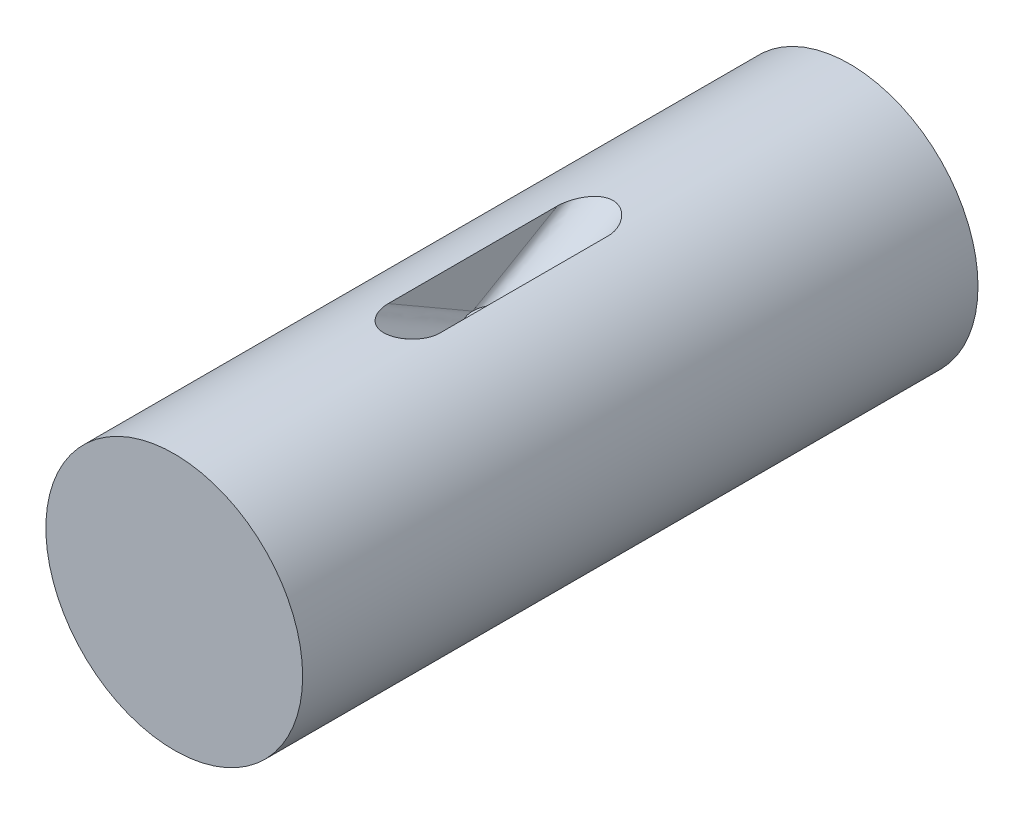
ISO-10303-21;
HEADER;
FILE_DESCRIPTION(('STEP AP214'),'2;1');
FILE_NAME('part.step','',(''),(''),'','','');
FILE_SCHEMA(('AUTOMOTIVE_DESIGN { 1 0 10303 214 1 1 1 1 }'));
ENDSEC;
DATA;
#1=APPLICATION_CONTEXT('core data for automotive mechanical design processes');
#2=APPLICATION_PROTOCOL_DEFINITION('international standard','automotive_design',2000,#1);
#3=PRODUCT_CONTEXT('',#1,'mechanical');
#4=PRODUCT('Part','Part','',(#3));
#5=PRODUCT_RELATED_PRODUCT_CATEGORY('part','',(#4));
#6=PRODUCT_DEFINITION_FORMATION('','',#4);
#7=PRODUCT_DEFINITION_CONTEXT('part definition',#1,'design');
#8=PRODUCT_DEFINITION('design','',#6,#7);
#9=PRODUCT_DEFINITION_SHAPE('','',#8);
#10=(LENGTH_UNIT() NAMED_UNIT(*) SI_UNIT(.MILLI.,.METRE.));
#11=(NAMED_UNIT(*) PLANE_ANGLE_UNIT() SI_UNIT($,.RADIAN.));
#12=(NAMED_UNIT(*) SI_UNIT($,.STERADIAN.) SOLID_ANGLE_UNIT());
#13=UNCERTAINTY_MEASURE_WITH_UNIT(LENGTH_MEASURE(1.E-05),#10,'distance_accuracy_value','');
#14=(GEOMETRIC_REPRESENTATION_CONTEXT(3) GLOBAL_UNCERTAINTY_ASSIGNED_CONTEXT((#13)) GLOBAL_UNIT_ASSIGNED_CONTEXT((#10,
#11,#12)) REPRESENTATION_CONTEXT('',''));
#15=CARTESIAN_POINT('',(0.,0.,0.));
#16=DIRECTION('',(0.,0.,1.));
#17=DIRECTION('',(1.,0.,0.));
#18=AXIS2_PLACEMENT_3D('',#15,#16,#17);
#19=CARTESIAN_POINT('',(-10.,0.,0.));
#20=DIRECTION('',(-1.,0.,0.));
#21=DIRECTION('',(0.,0.,1.));
#22=AXIS2_PLACEMENT_3D('',#19,#20,#21);
#23=PLANE('',#22);
#24=DIRECTION('',(0.,0.500000000000001,0.866025403784438));
#25=VECTOR('',#24,1.);
#26=CARTESIAN_POINT('',(-10.,30.,136.7674785701));
#27=LINE('',#26,#25);
#28=CARTESIAN_POINT('',(-9.99999999999999,30.,136.7674785701));
#29=VERTEX_POINT('',#28);
#30=CARTESIAN_POINT('',(-10.,48.9897948556636,169.658768085419));
#31=VERTEX_POINT('',#30);
#32=EDGE_CURVE('E85',#29,#31,#27,.T.);
#33=ORIENTED_EDGE('',*,*,#32,.F.);
#34=DIRECTION('',(0.,0.500000000000001,-0.866025403784438));
#35=VECTOR('',#34,1.);
#36=CARTESIAN_POINT('',(-10.,30.,136.7674785701));
#37=LINE('',#36,#35);
#38=CARTESIAN_POINT('',(-10.,48.9897948556636,103.87618905478));
#39=VERTEX_POINT('',#38);
#40=EDGE_CURVE('E71',#29,#39,#37,.T.);
#41=ORIENTED_EDGE('',*,*,#40,.T.);
#42=DIRECTION('',(0.,0.,-1.));
#43=VECTOR('',#42,1.);
#44=CARTESIAN_POINT('',(-10.,48.9897948556636,263.));
#45=LINE('',#44,#43);
#46=EDGE_CURVE('E106',#31,#39,#45,.T.);
#47=ORIENTED_EDGE('',*,*,#46,.F.);
#48=EDGE_LOOP('',(#33,#41,#47));
#49=FACE_BOUND('',#48,.T.);
#50=ADVANCED_FACE('F60',(#49),#23,.F.);
#51=CARTESIAN_POINT('',(0.,30.,136.7674785701));
#52=DIRECTION('',(0.,1.,0.));
#53=DIRECTION('',(0.,0.,1.));
#54=AXIS2_PLACEMENT_3D('',#51,#52,#53);
#55=CIRCLE('',#54,9.99999999999999);
#56=DIRECTION('',(0.,0.500000000000001,0.866025403784438));
#57=VECTOR('',#56,1.);
#58=SURFACE_OF_LINEAR_EXTRUSION('',#55,#57);
#59=DIRECTION('',(0.,0.500000000000001,0.866025403784438));
#60=VECTOR('',#59,1.);
#61=CARTESIAN_POINT('',(10.,30.,136.7674785701));
#62=LINE('',#61,#60);
#63=CARTESIAN_POINT('',(9.99999999999999,30.,136.7674785701));
#64=VERTEX_POINT('',#63);
#65=CARTESIAN_POINT('',(9.99999999999999,48.9897948556636,169.658768085419));
#66=VERTEX_POINT('',#65);
#67=EDGE_CURVE('E14',#64,#66,#62,.T.);
#68=ORIENTED_EDGE('',*,*,#67,.F.);
#69=CARTESIAN_POINT('',(0.,30.,136.7674785701));
#70=DIRECTION('',(0.,1.,0.));
#71=DIRECTION('',(0.,0.,1.));
#72=AXIS2_PLACEMENT_3D('',#69,#70,#71);
#73=CIRCLE('',#72,9.99999999999999);
#74=EDGE_CURVE('E77',#29,#64,#73,.T.);
#75=ORIENTED_EDGE('',*,*,#74,.F.);
#76=ORIENTED_EDGE('',*,*,#32,.T.);
#77=CARTESIAN_POINT('',(9.99999999999999,48.9897948556636,169.658768085419));
#78=CARTESIAN_POINT('',(9.99998830047568,48.9897926273459,169.8665816161));
#79=CARTESIAN_POINT('',(9.99352233743252,48.9911171356158,170.074343291986));
#80=CARTESIAN_POINT('',(9.96848354468941,48.9962204179087,170.488814257056));
#81=CARTESIAN_POINT('',(9.94992807804395,48.9999956721201,170.695524627699));
#82=CARTESIAN_POINT('',(9.90151605074032,49.0098006036935,171.107469975176));
#83=CARTESIAN_POINT('',(9.87166353401655,49.0158294743331,171.312705453212));
#84=CARTESIAN_POINT('',(9.8014739695633,49.0299132212895,171.720474961464));
#85=CARTESIAN_POINT('',(9.76117806287824,49.0379601436893,171.923016384806));
#86=CARTESIAN_POINT('',(9.67062226873041,49.0558986644493,172.325846038853));
#87=CARTESIAN_POINT('',(9.62035887017794,49.0657909127599,172.526133449227));
#88=CARTESIAN_POINT('',(9.51037757363829,49.0872269884544,172.924020559172));
#89=CARTESIAN_POINT('',(9.45065835361229,49.0987710467597,173.121619878714));
#90=CARTESIAN_POINT('',(9.28608459291831,49.1302258532902,173.624004154824));
#91=CARTESIAN_POINT('',(9.17472643871901,49.1511924592319,173.926614374921));
#92=CARTESIAN_POINT('',(8.93128216560779,49.1960111228789,174.523084850676));
#93=CARTESIAN_POINT('',(8.79919784648421,49.2198629300021,174.816945863452));
#94=CARTESIAN_POINT('',(8.51483599936621,49.26985344743,175.395360951603));
#95=CARTESIAN_POINT('',(8.36251368921055,49.2959971843094,175.679892589956));
#96=CARTESIAN_POINT('',(8.03846755289753,49.349873556924,176.237540683074));
#97=CARTESIAN_POINT('',(7.86674339725267,49.3776062196387,176.510656943871));
#98=CARTESIAN_POINT('',(7.50125774190784,49.4344606046001,177.048168827099));
#99=CARTESIAN_POINT('',(7.30718352420845,49.4635975746352,177.312350665298));
#100=CARTESIAN_POINT('',(6.89944438188211,49.5221171701604,177.825193069468));
#101=CARTESIAN_POINT('',(6.68577772151978,49.5514998172055,178.073852256969));
#102=CARTESIAN_POINT('',(6.23936303756008,49.6096858176845,178.552664250905));
#103=CARTESIAN_POINT('',(6.00665131865289,49.6384901487053,178.782850684533));
#104=CARTESIAN_POINT('',(5.52188385272652,49.6947514011369,179.222255621507));
#105=CARTESIAN_POINT('',(5.26982612323368,49.7222081839843,179.431471970874));
#106=CARTESIAN_POINT('',(4.81316637552274,49.7681817897422,179.775342992222));
#107=CARTESIAN_POINT('',(4.61271746371333,49.7872013667954,179.915460085505));
#108=CARTESIAN_POINT('',(4.2018005272732,49.8235624723493,180.180187218837));
#109=CARTESIAN_POINT('',(3.99133847966239,49.8409049836268,180.304806353239));
#110=CARTESIAN_POINT('',(3.56097409136249,49.8735000681915,180.536766894517));
#111=CARTESIAN_POINT('',(3.34107401839852,49.8887531398683,180.644112422701));
#112=CARTESIAN_POINT('',(2.89273298542063,49.9167559778084,180.839683581401));
#113=CARTESIAN_POINT('',(2.66429190365826,49.9295057083715,180.927908939245));
#114=CARTESIAN_POINT('',(2.19799044377646,49.9522154167233,181.084169486809));
#115=CARTESIAN_POINT('',(1.96006080350947,49.9621475040982,181.15200319768));
#116=CARTESIAN_POINT('',(1.4786826730303,49.9787102233752,181.264707165614));
#117=CARTESIAN_POINT('',(1.23523424974784,49.9853408952933,181.30957770101));
#118=CARTESIAN_POINT('',(0.745216840140189,49.9950462490392,181.375145063926));
#119=CARTESIAN_POINT('',(0.498650525057148,49.9981237905838,181.395861332003));
#120=CARTESIAN_POINT('',(0.00466975628192549,50.0006095448925,181.412599898025));
#121=CARTESIAN_POINT('',(-0.242744608365769,50.0000181317699,181.40862471369));
#122=CARTESIAN_POINT('',(-0.701059435398237,49.9955339124995,181.378409182358));
#123=CARTESIAN_POINT('',(-0.912184743305883,49.9921188575404,181.355390604492));
#124=CARTESIAN_POINT('',(-1.3316500033895,49.9827040011967,181.291722298435));
#125=CARTESIAN_POINT('',(-1.53999057932644,49.9767047889991,181.251076589212));
#126=CARTESIAN_POINT('',(-1.95259366866737,49.9622858766864,181.152926911088));
#127=CARTESIAN_POINT('',(-2.15685551080396,49.9538657816032,181.095420191276));
#128=CARTESIAN_POINT('',(-2.56021786595424,49.9348183562031,180.964536150793));
#129=CARTESIAN_POINT('',(-2.75931562931149,49.9241898760918,180.891150561972));
#130=CARTESIAN_POINT('',(-3.15566752291613,49.9007218093745,180.727890278737));
#131=CARTESIAN_POINT('',(-3.3527834720485,49.887838516404,180.637686774186));
#132=CARTESIAN_POINT('',(-3.73985062776482,49.8603170633689,180.443216769276));
#133=CARTESIAN_POINT('',(-3.92979883715714,49.845678179663,180.338944467637));
#134=CARTESIAN_POINT('',(-4.4881815975688,49.7995542242771,180.006864278715));
#135=CARTESIAN_POINT('',(-4.84521478140912,49.7658581143308,179.75976757416));
#136=CARTESIAN_POINT('',(-5.31515426337418,49.7168607967768,179.38993532514));
#137=CARTESIAN_POINT('',(-5.4425770045093,49.703060235772,179.284711631344));
#138=CARTESIAN_POINT('',(-5.69245004251482,49.6750619678175,179.068737853951));
#139=CARTESIAN_POINT('',(-5.81490442266258,49.6608646038844,178.957992482374));
#140=CARTESIAN_POINT('',(-6.17484001306514,49.6178373250868,178.618053163425));
#141=CARTESIAN_POINT('',(-6.40498070253377,49.5885630022293,178.381086973059));
#142=CARTESIAN_POINT('',(-6.8452080978794,49.5297122894112,177.889781759966));
#143=CARTESIAN_POINT('',(-7.05531418103913,49.5001362225907,177.635459940523));
#144=CARTESIAN_POINT('',(-7.45570777284242,49.4414134006743,177.111605607384));
#145=CARTESIAN_POINT('',(-7.64599344952364,49.4122666854759,176.842071691208));
#146=CARTESIAN_POINT('',(-8.0064256054254,49.3551458438685,176.289984621609));
#147=CARTESIAN_POINT('',(-8.17658341987032,49.3271710632604,176.00743892168));
#148=CARTESIAN_POINT('',(-8.49650080492568,49.2730736749369,175.430838323303));
#149=CARTESIAN_POINT('',(-8.64625917775937,49.2469511760237,175.136782750342));
#150=CARTESIAN_POINT('',(-8.92469467089923,49.197254244347,174.538584172106));
#151=CARTESIAN_POINT('',(-9.05336832299636,49.1736802309984,174.234439517159));
#152=CARTESIAN_POINT('',(-9.28851769196799,49.1298050450254,173.617507117129));
#153=CARTESIAN_POINT('',(-9.39499866041593,49.1095030983726,173.304721436704));
#154=CARTESIAN_POINT('',(-9.57007976645812,49.0756587658214,172.719295804332));
#155=CARTESIAN_POINT('',(-9.64196595049304,49.0615592685179,172.447669354445));
#156=CARTESIAN_POINT('',(-9.76740056857745,49.0367408764408,171.900050940189));
#157=CARTESIAN_POINT('',(-9.82095004902702,49.0260217887638,171.62405922587));
#158=CARTESIAN_POINT('',(-9.90840755413823,49.0084234309738,171.067582369714));
#159=CARTESIAN_POINT('',(-9.94222985658835,49.0015609238326,170.787082980402));
#160=CARTESIAN_POINT('',(-9.98801253143378,48.9922421342431,170.224034599776));
#161=CARTESIAN_POINT('',(-9.99995567730586,48.9897893237916,169.941484169141));
#162=CARTESIAN_POINT('',(-10.,48.9897948556636,169.658768085419));
#163=B_SPLINE_CURVE_WITH_KNOTS('',3,(#77,#78,#79,#80,#81,#82,#83,#84,#85,#86,#87,#88,#89,#90,
#91,#92,#93,#94,#95,#96,#97,#98,#99,#100,#101,#102,#103,#104,#105,#106,#107,#108,#109,#110,#111,
#112,#113,#114,#115,#116,#117,#118,#119,#120,#121,#122,#123,#124,#125,#126,#127,#128,#129,#130,
#131,#132,#133,#134,#135,#136,#137,#138,#139,#140,#141,#142,#143,#144,#145,#146,#147,#148,#149,
#150,#151,#152,#153,#154,#155,#156,#157,#158,#159,#160,#161,#162),.UNSPECIFIED.,.F.,.F.,(4,2,2,
2,2,2,2,2,2,2,2,2,2,2,2,2,2,2,2,2,2,2,2,2,2,2,2,2,2,2,2,2,2,2,2,2,2,2,2,2,2,2,4),(0.,
0.623261198783301,1.24562923153744,1.8677746895121,2.48750554661396,3.10745509546309,
3.72749139745842,4.69600161653359,5.66442778003172,6.63503369883991,7.60565610322461,
8.59204858956473,9.57852854705757,10.5631699716544,11.5479124319973,12.2832025708671,
13.0180591777018,13.7527401943768,14.487431687613,15.2291601833236,15.9708796884377,
16.7120018077648,17.4530483581469,18.0895011771621,18.7258089618579,19.362220619397,
19.9989644583103,20.6497920265753,21.3008887890655,22.602886678842,23.1002866520965,
23.5972691926116,24.5909010527018,25.5835619207418,26.5763144572678,27.5685052255199,
28.5607542263081,29.553166277865,30.5453432223466,31.3887364438219,32.2320815282995,
33.0790644839579,33.9267140243158),.UNSPECIFIED.);
#164=EDGE_CURVE('E109',#66,#31,#163,.T.);
#165=ORIENTED_EDGE('',*,*,#164,.F.);
#166=EDGE_LOOP('',(#68,#75,#76,#165));
#167=FACE_BOUND('',#166,.T.);
#168=ADVANCED_FACE('F62',(#167),#58,.F.);
#169=CARTESIAN_POINT('',(0.,30.,136.7674785701));
#170=DIRECTION('',(0.,1.,0.));
#171=DIRECTION('',(0.,0.,1.));
#172=AXIS2_PLACEMENT_3D('',#169,#170,#171);
#173=CIRCLE('',#172,9.99999999999999);
#174=DIRECTION('',(0.,0.500000000000001,-0.866025403784438));
#175=VECTOR('',#174,1.);
#176=SURFACE_OF_LINEAR_EXTRUSION('',#173,#175);
#177=ORIENTED_EDGE('',*,*,#40,.F.);
#178=EDGE_CURVE('E115',#64,#29,#73,.T.);
#179=ORIENTED_EDGE('',*,*,#178,.F.);
#180=DIRECTION('',(0.,0.500000000000001,-0.866025403784438));
#181=VECTOR('',#180,1.);
#182=CARTESIAN_POINT('',(10.,30.,136.7674785701));
#183=LINE('',#182,#181);
#184=CARTESIAN_POINT('',(10.,48.9897948556636,103.87618905478));
#185=VERTEX_POINT('',#184);
#186=EDGE_CURVE('E113',#64,#185,#183,.T.);
#187=ORIENTED_EDGE('',*,*,#186,.T.);
#188=CARTESIAN_POINT('',(-9.99999999999999,48.9897948556636,103.87618905478));
#189=CARTESIAN_POINT('',(-9.99999641210466,48.9897944095732,103.722805033978));
#190=CARTESIAN_POINT('',(-9.99647130248378,48.9905152782992,103.569452737715));
#191=CARTESIAN_POINT('',(-9.98270272980579,48.9933232103999,103.263094366053));
#192=CARTESIAN_POINT('',(-9.97246076125053,48.9954099698635,103.110088221233));
#193=CARTESIAN_POINT('',(-9.93218459375668,49.0035967228507,102.652372756309));
#194=CARTESIAN_POINT('',(-9.89259813361409,49.0116236568976,102.348500854289));
#195=CARTESIAN_POINT('',(-9.79027381917747,49.0321652934431,101.745209740727));
#196=CARTESIAN_POINT('',(-9.72755696159535,49.0446759255567,101.445786746317));
#197=CARTESIAN_POINT('',(-9.58079239593233,49.0735570644355,100.852276843411));
#198=CARTESIAN_POINT('',(-9.4967337587753,49.0899295485405,100.558192751884));
#199=CARTESIAN_POINT('',(-9.28536745002111,49.1304005899599,99.9042627831707));
#200=CARTESIAN_POINT('',(-9.15250271413167,49.1554078975375,99.5462627395628));
#201=CARTESIAN_POINT('',(-8.85789270031034,49.2093503089196,98.8426826258742));
#202=CARTESIAN_POINT('',(-8.69614577134181,49.2382856372448,98.4971032671734));
#203=CARTESIAN_POINT('',(-8.34629625962587,49.2987894716349,97.8228210085079));
#204=CARTESIAN_POINT('',(-8.15838231398795,49.3303385284937,97.49401850309));
#205=CARTESIAN_POINT('',(-7.75608563372831,49.3951886159152,96.8531541228351));
#206=CARTESIAN_POINT('',(-7.54170251815532,49.4284896716892,96.5410924890298));
#207=CARTESIAN_POINT('',(-7.10992342369224,49.4923392987607,95.9673782578026));
#208=CARTESIAN_POINT('',(-6.89504378671255,49.5228240070936,95.7038246110953));
#209=CARTESIAN_POINT('',(-6.44439465440292,49.5834794357238,95.1953710435509));
#210=CARTESIAN_POINT('',(-6.20863800023926,49.6136503364511,94.950459826066));
#211=CARTESIAN_POINT('',(-5.75080424910977,49.6686388807887,94.51518073542));
#212=CARTESIAN_POINT('',(-5.53144051871874,49.6936141765922,94.3219791154816));
#213=CARTESIAN_POINT('',(-5.07714758920778,49.7420829266853,93.9537647841707));
#214=CARTESIAN_POINT('',(-4.84219541629191,49.7655740895712,93.7787799409197));
#215=CARTESIAN_POINT('',(-4.38670739774167,49.8076562994917,93.4699263128522));
#216=CARTESIAN_POINT('',(-4.16783310136542,49.8264969428596,93.3336435611635));
#217=CARTESIAN_POINT('',(-3.71936495868816,49.861978352828,93.0797364010654));
#218=CARTESIAN_POINT('',(-3.48977386993391,49.8786196811596,92.9621072267713));
#219=CARTESIAN_POINT('',(-3.0211922501466,49.9091918007512,92.7478307058195));
#220=CARTESIAN_POINT('',(-2.78221599838763,49.9231265315493,92.651152839771));
#221=CARTESIAN_POINT('',(-2.29617599419557,49.9478398943873,92.4807581234825));
#222=CARTESIAN_POINT('',(-2.04911760762181,49.9586205749992,92.407026367632));
#223=CARTESIAN_POINT('',(-1.5651147888646,49.9760460311467,92.288329745447));
#224=CARTESIAN_POINT('',(-1.32856222973698,49.9829147679204,92.2418018072651));
#225=CARTESIAN_POINT('',(-0.851995737417125,49.993308240126,92.1715321866054));
#226=CARTESIAN_POINT('',(-0.611981925245869,49.9968330921886,92.1477897093965));
#227=CARTESIAN_POINT('',(-0.164301898454126,50.0001593277341,92.125387606336));
#228=CARTESIAN_POINT('',(0.0432145768539689,50.0004108664354,92.1236954987592));
#229=CARTESIAN_POINT('',(0.457712772118137,49.9983344846298,92.1376766438025));
#230=CARTESIAN_POINT('',(0.664694327873151,49.9960058489929,92.1533547108008));
#231=CARTESIAN_POINT('',(1.07683844037935,49.9888283194826,92.2018058023174));
#232=CARTESIAN_POINT('',(1.28199857498156,49.9839764685449,92.2345988848189));
#233=CARTESIAN_POINT('',(1.68889774230486,49.9718826647317,92.316666639753));
#234=CARTESIAN_POINT('',(1.89063696602406,49.9646408457592,92.3659403888236));
#235=CARTESIAN_POINT('',(2.29169828388222,49.9478612582689,92.4807215471629));
#236=CARTESIAN_POINT('',(2.49097054135225,49.9382994748269,92.5463989818614));
#237=CARTESIAN_POINT('',(2.88385492273898,49.9171523104019,92.6926427018369));
#238=CARTESIAN_POINT('',(3.07746671109424,49.9055668097325,92.7732098677359));
#239=CARTESIAN_POINT('',(3.45818023073844,49.8806312291403,92.9480383665452));
#240=CARTESIAN_POINT('',(3.64528440947118,49.8672818218709,93.0422944806232));
#241=CARTESIAN_POINT('',(4.01252194664324,49.8390770617019,93.2433554771638));
#242=CARTESIAN_POINT('',(4.19265381722537,49.8242213897942,93.3501630186283));
#243=CARTESIAN_POINT('',(4.62464653470011,49.7863278018505,93.6256270355053));
#244=CARTESIAN_POINT('',(4.87247187523599,49.762606799986,93.8005487510026));
#245=CARTESIAN_POINT('',(5.3517085327017,49.7133507724655,94.1709158017532));
#246=CARTESIAN_POINT('',(5.58312998918216,49.6878168872751,94.3663482702751));
#247=CARTESIAN_POINT('',(6.02922587261187,49.6356606565737,94.7748226798489));
#248=CARTESIAN_POINT('',(6.24391815411351,49.6090395190357,94.9878453328854));
#249=CARTESIAN_POINT('',(6.65674387115357,49.5553337170895,95.4293349190969));
#250=CARTESIAN_POINT('',(6.85487383727429,49.5282489569877,95.6578050701212));
#251=CARTESIAN_POINT('',(7.28196372638538,49.4674687859554,96.1869976134588));
#252=CARTESIAN_POINT('',(7.50624987548817,49.4338133209017,96.4915048258377));
#253=CARTESIAN_POINT('',(7.92859957359785,49.3678335402814,97.1183248852335));
#254=CARTESIAN_POINT('',(8.12665913256146,49.3355094277773,97.4406404310153));
#255=CARTESIAN_POINT('',(8.49590694137225,49.2732645080763,98.100344671547));
#256=CARTESIAN_POINT('',(8.66710661920204,49.2433426814473,98.4377268770166));
#257=CARTESIAN_POINT('',(8.98168828591813,49.1869374075427,99.1255237703203));
#258=CARTESIAN_POINT('',(9.12507002663586,49.1604539909424,99.4759385743874));
#259=CARTESIAN_POINT('',(9.36887866424843,49.1145379991328,100.15064835866));
#260=CARTESIAN_POINT('',(9.47222540049095,49.0946581879331,100.473857717968));
#261=CARTESIAN_POINT('',(9.6534002080203,49.0593557140957,101.127439256417));
#262=CARTESIAN_POINT('',(9.73124156597243,49.0439307312765,101.457807610244));
#263=CARTESIAN_POINT('',(9.86101128162087,49.0180070165579,102.134015519237));
#264=CARTESIAN_POINT('',(9.91211097480809,49.0076663610433,102.480024430204));
#265=CARTESIAN_POINT('',(9.96423179359222,48.9970853673587,103.001813221599));
#266=CARTESIAN_POINT('',(9.97751819671417,48.9943798170601,103.176370756246));
#267=CARTESIAN_POINT('',(9.99540054004501,48.9907339355815,103.525998602349));
#268=CARTESIAN_POINT('',(9.99999380885422,48.9897941470208,103.701069054878));
#269=CARTESIAN_POINT('',(10.,48.9897948556636,103.87618905478));
#270=B_SPLINE_CURVE_WITH_KNOTS('',3,(#188,#189,#190,#191,#192,#193,#194,#195,#196,#197,#198,
#199,#200,#201,#202,#203,#204,#205,#206,#207,#208,#209,#210,#211,#212,#213,#214,#215,#216,#217,
#218,#219,#220,#221,#222,#223,#224,#225,#226,#227,#228,#229,#230,#231,#232,#233,#234,#235,#236,
#237,#238,#239,#240,#241,#242,#243,#244,#245,#246,#247,#248,#249,#250,#251,#252,#253,#254,#255,
#256,#257,#258,#259,#260,#261,#262,#263,#264,#265,#266,#267,#268,#269),.UNSPECIFIED.,.F.,.F.,(4,
2,2,2,2,2,2,2,2,2,2,2,2,2,2,2,2,2,2,2,2,2,2,2,2,2,2,2,2,2,2,2,2,2,2,2,2,2,2,2,4),(0.,
0.460055324292828,0.920008320939489,1.83852245717655,2.75620485250647,3.6743581421011,
4.82098371265241,5.96767485049821,7.10649063519639,8.24532281194281,9.26851683961239,
10.2910858290581,11.1703453064353,12.0509307021635,12.8256740581669,13.6002191515524,
14.3736282801105,15.1465339545031,15.8690095576317,16.5914599607157,17.2133062248622,
17.8353248852168,18.4580741642014,19.0807885582686,19.7102467091872,20.3397421000151,
20.9689981263139,21.598387700738,22.5098623865732,23.4207686689238,24.3306890592804,
25.240799581511,26.3784129268479,27.5161991472746,28.6534999571437,29.7908109126013,
30.8095503557237,31.8277582540926,32.8758860806414,33.4009378634668,33.9261509684924),.UNSPECIFIED.);
#271=EDGE_CURVE('E99',#39,#185,#270,.T.);
#272=ORIENTED_EDGE('',*,*,#271,.F.);
#273=EDGE_LOOP('',(#177,#179,#187,#272));
#274=FACE_BOUND('',#273,.T.);
#275=ADVANCED_FACE('F114',(#274),#176,.F.);
#276=CARTESIAN_POINT('',(0.,30.,0.));
#277=DIRECTION('',(0.,1.,0.));
#278=DIRECTION('',(0.,0.,1.));
#279=AXIS2_PLACEMENT_3D('',#276,#277,#278);
#280=PLANE('',#279);
#281=ORIENTED_EDGE('',*,*,#178,.T.);
#282=ORIENTED_EDGE('',*,*,#74,.T.);
#283=EDGE_LOOP('',(#281,#282));
#284=FACE_BOUND('',#283,.T.);
#285=ADVANCED_FACE('F142',(#284),#280,.T.);
#286=CARTESIAN_POINT('',(10.,0.,0.));
#287=DIRECTION('',(-1.,0.,0.));
#288=DIRECTION('',(0.,0.,1.));
#289=AXIS2_PLACEMENT_3D('',#286,#287,#288);
#290=PLANE('',#289);
#291=ORIENTED_EDGE('',*,*,#67,.T.);
#292=DIRECTION('',(0.,0.,-1.));
#293=VECTOR('',#292,1.);
#294=CARTESIAN_POINT('',(10.,48.9897948556636,263.));
#295=LINE('',#294,#293);
#296=EDGE_CURVE('E105',#66,#185,#295,.T.);
#297=ORIENTED_EDGE('',*,*,#296,.T.);
#298=ORIENTED_EDGE('',*,*,#186,.F.);
#299=EDGE_LOOP('',(#291,#297,#298));
#300=FACE_BOUND('',#299,.T.);
#301=ADVANCED_FACE('F120',(#300),#290,.T.);
#302=CARTESIAN_POINT('',(0.,0.,0.));
#303=DIRECTION('',(0.,0.,1.));
#304=DIRECTION('',(1.,0.,0.));
#305=AXIS2_PLACEMENT_3D('',#302,#303,#304);
#306=PLANE('',#305);
#307=CARTESIAN_POINT('',(0.,0.,0.));
#308=DIRECTION('',(0.,0.,1.));
#309=DIRECTION('',(1.,0.,0.));
#310=AXIS2_PLACEMENT_3D('',#307,#308,#309);
#311=CIRCLE('',#310,50.);
#312=CARTESIAN_POINT('',(50.,0.,0.));
#313=VERTEX_POINT('',#312);
#314=EDGE_CURVE('E118',#313,#313,#311,.T.);
#315=ORIENTED_EDGE('',*,*,#314,.F.);
#316=EDGE_LOOP('',(#315));
#317=FACE_BOUND('',#316,.T.);
#318=ADVANCED_FACE('F160',(#317),#306,.F.);
#319=CARTESIAN_POINT('',(0.,0.,263.));
#320=DIRECTION('',(0.,0.,1.));
#321=DIRECTION('',(1.,0.,0.));
#322=AXIS2_PLACEMENT_3D('',#319,#320,#321);
#323=PLANE('',#322);
#324=CARTESIAN_POINT('',(0.,0.,263.));
#325=DIRECTION('',(0.,0.,1.));
#326=DIRECTION('',(1.,0.,0.));
#327=AXIS2_PLACEMENT_3D('',#324,#325,#326);
#328=CIRCLE('',#327,50.);
#329=CARTESIAN_POINT('',(50.,0.,263.));
#330=VERTEX_POINT('',#329);
#331=EDGE_CURVE('E154',#330,#330,#328,.T.);
#332=ORIENTED_EDGE('',*,*,#331,.T.);
#333=EDGE_LOOP('',(#332));
#334=FACE_BOUND('',#333,.T.);
#335=ADVANCED_FACE('F191',(#334),#323,.T.);
#336=CARTESIAN_POINT('',(0.,0.,263.));
#337=DIRECTION('',(0.,0.,-1.));
#338=DIRECTION('',(-1.,0.,0.));
#339=AXIS2_PLACEMENT_3D('',#336,#337,#338);
#340=CYLINDRICAL_SURFACE('',#339,50.);
#341=ORIENTED_EDGE('',*,*,#46,.T.);
#342=ORIENTED_EDGE('',*,*,#271,.T.);
#343=ORIENTED_EDGE('',*,*,#296,.F.);
#344=ORIENTED_EDGE('',*,*,#164,.T.);
#345=EDGE_LOOP('',(#341,#342,#343,#344));
#346=FACE_BOUND('',#345,.T.);
#347=ORIENTED_EDGE('',*,*,#331,.F.);
#348=EDGE_LOOP('',(#347));
#349=FACE_BOUND('',#348,.T.);
#350=ORIENTED_EDGE('',*,*,#314,.T.);
#351=EDGE_LOOP('',(#350));
#352=FACE_BOUND('',#351,.T.);
#353=ADVANCED_FACE('F101',(#346,#349,#352),#340,.T.);
#354=CLOSED_SHELL('',(#50,#168,#275,#285,#301,#318,#335,#353));
#355=MANIFOLD_SOLID_BREP('B2',#354);
#356=ADVANCED_BREP_SHAPE_REPRESENTATION('',(#18,#355),#14);
#357=SHAPE_DEFINITION_REPRESENTATION(#9,#356);
ENDSEC;
END-ISO-10303-21;
